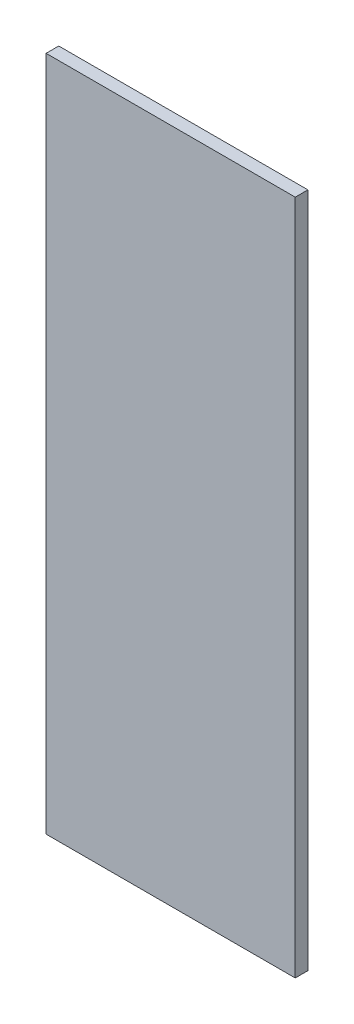
ISO-10303-21;
HEADER;
FILE_DESCRIPTION(('STEP AP214'),'2;1');
FILE_NAME('part.step','',(''),(''),'','','');
FILE_SCHEMA(('AUTOMOTIVE_DESIGN { 1 0 10303 214 1 1 1 1 }'));
ENDSEC;
DATA;
#1=APPLICATION_CONTEXT('core data for automotive mechanical design processes');
#2=APPLICATION_PROTOCOL_DEFINITION('international standard','automotive_design',2000,#1);
#3=PRODUCT_CONTEXT('',#1,'mechanical');
#4=PRODUCT('Part','Part','',(#3));
#5=PRODUCT_RELATED_PRODUCT_CATEGORY('part','',(#4));
#6=PRODUCT_DEFINITION_FORMATION('','',#4);
#7=PRODUCT_DEFINITION_CONTEXT('part definition',#1,'design');
#8=PRODUCT_DEFINITION('design','',#6,#7);
#9=PRODUCT_DEFINITION_SHAPE('','',#8);
#10=(LENGTH_UNIT() NAMED_UNIT(*) SI_UNIT(.MILLI.,.METRE.));
#11=(NAMED_UNIT(*) PLANE_ANGLE_UNIT() SI_UNIT($,.RADIAN.));
#12=(NAMED_UNIT(*) SI_UNIT($,.STERADIAN.) SOLID_ANGLE_UNIT());
#13=UNCERTAINTY_MEASURE_WITH_UNIT(LENGTH_MEASURE(1.E-05),#10,'distance_accuracy_value','');
#14=(GEOMETRIC_REPRESENTATION_CONTEXT(3) GLOBAL_UNCERTAINTY_ASSIGNED_CONTEXT((#13)) GLOBAL_UNIT_ASSIGNED_CONTEXT((#10,
#11,#12)) REPRESENTATION_CONTEXT('',''));
#15=CARTESIAN_POINT('',(0.,0.,0.));
#16=DIRECTION('',(0.,0.,1.));
#17=DIRECTION('',(1.,0.,0.));
#18=AXIS2_PLACEMENT_3D('',#15,#16,#17);
#19=CARTESIAN_POINT('',(94.1920013427735,76.5279998779297,0.));
#20=DIRECTION('',(1.,0.,0.));
#21=DIRECTION('',(0.,-1.,0.));
#22=AXIS2_PLACEMENT_3D('',#19,#20,#21);
#23=PLANE('',#22);
#24=DIRECTION('',(0.,-1.,0.));
#25=VECTOR('',#24,1.);
#26=CARTESIAN_POINT('',(94.1920013427734,76.5279998779297,0.03556));
#27=LINE('',#26,#25);
#28=CARTESIAN_POINT('',(94.1920013427734,76.5279998779297,0.03556));
#29=VERTEX_POINT('',#28);
#30=CARTESIAN_POINT('',(94.1920013427734,74.6279983520508,0.03556));
#31=VERTEX_POINT('',#30);
#32=EDGE_CURVE('E11',#29,#31,#27,.T.);
#33=ORIENTED_EDGE('',*,*,#32,.F.);
#34=DIRECTION('',(0.,0.,1.));
#35=VECTOR('',#34,1.);
#36=CARTESIAN_POINT('',(94.1920013427734,76.5279998779297,0.));
#37=LINE('',#36,#35);
#38=CARTESIAN_POINT('',(94.1920013427734,76.5279998779297,0.));
#39=VERTEX_POINT('',#38);
#40=EDGE_CURVE('E24',#39,#29,#37,.T.);
#41=ORIENTED_EDGE('',*,*,#40,.F.);
#42=DIRECTION('',(0.,-1.,0.));
#43=VECTOR('',#42,1.);
#44=CARTESIAN_POINT('',(94.1920013427734,76.5279998779297,0.));
#45=LINE('',#44,#43);
#46=CARTESIAN_POINT('',(94.1920013427734,74.6279983520508,0.));
#47=VERTEX_POINT('',#46);
#48=EDGE_CURVE('E75',#39,#47,#45,.T.);
#49=ORIENTED_EDGE('',*,*,#48,.T.);
#50=DIRECTION('',(0.,0.,1.));
#51=VECTOR('',#50,1.);
#52=CARTESIAN_POINT('',(94.1920013427734,74.6279983520508,0.));
#53=LINE('',#52,#51);
#54=EDGE_CURVE('E37',#47,#31,#53,.T.);
#55=ORIENTED_EDGE('',*,*,#54,.T.);
#56=EDGE_LOOP('',(#33,#41,#49,#55));
#57=FACE_BOUND('',#56,.T.);
#58=ADVANCED_FACE('F17',(#57),#23,.F.);
#59=CARTESIAN_POINT('',(94.1920013427735,74.6279983520508,0.));
#60=DIRECTION('',(0.,1.,0.));
#61=DIRECTION('',(1.,0.,0.));
#62=AXIS2_PLACEMENT_3D('',#59,#60,#61);
#63=PLANE('',#62);
#64=DIRECTION('',(1.,0.,0.));
#65=VECTOR('',#64,1.);
#66=CARTESIAN_POINT('',(94.1920013427734,74.6279983520508,0.03556));
#67=LINE('',#66,#65);
#68=CARTESIAN_POINT('',(94.8919982910156,74.6279983520508,0.03556));
#69=VERTEX_POINT('',#68);
#70=EDGE_CURVE('E83',#31,#69,#67,.T.);
#71=ORIENTED_EDGE('',*,*,#70,.F.);
#72=ORIENTED_EDGE('',*,*,#54,.F.);
#73=DIRECTION('',(1.,0.,0.));
#74=VECTOR('',#73,1.);
#75=CARTESIAN_POINT('',(94.1920013427734,74.6279983520508,0.));
#76=LINE('',#75,#74);
#77=CARTESIAN_POINT('',(94.8919982910156,74.6279983520508,0.));
#78=VERTEX_POINT('',#77);
#79=EDGE_CURVE('E81',#47,#78,#76,.T.);
#80=ORIENTED_EDGE('',*,*,#79,.T.);
#81=DIRECTION('',(0.,0.,1.));
#82=VECTOR('',#81,1.);
#83=CARTESIAN_POINT('',(94.8919982910156,74.6279983520508,0.));
#84=LINE('',#83,#82);
#85=EDGE_CURVE('E67',#78,#69,#84,.T.);
#86=ORIENTED_EDGE('',*,*,#85,.T.);
#87=EDGE_LOOP('',(#71,#72,#80,#86));
#88=FACE_BOUND('',#87,.T.);
#89=ADVANCED_FACE('F89',(#88),#63,.F.);
#90=CARTESIAN_POINT('',(94.8919982910156,74.6279983520508,0.));
#91=DIRECTION('',(-1.,0.,0.));
#92=DIRECTION('',(0.,1.,0.));
#93=AXIS2_PLACEMENT_3D('',#90,#91,#92);
#94=PLANE('',#93);
#95=DIRECTION('',(0.,1.,0.));
#96=VECTOR('',#95,1.);
#97=CARTESIAN_POINT('',(94.8919982910156,74.6279983520508,0.03556));
#98=LINE('',#97,#96);
#99=CARTESIAN_POINT('',(94.8919982910156,76.5279998779297,0.03556));
#100=VERTEX_POINT('',#99);
#101=EDGE_CURVE('E71',#69,#100,#98,.T.);
#102=ORIENTED_EDGE('',*,*,#101,.F.);
#103=ORIENTED_EDGE('',*,*,#85,.F.);
#104=DIRECTION('',(0.,1.,0.));
#105=VECTOR('',#104,1.);
#106=CARTESIAN_POINT('',(94.8919982910156,74.6279983520508,0.));
#107=LINE('',#106,#105);
#108=CARTESIAN_POINT('',(94.8919982910156,76.5279998779297,0.));
#109=VERTEX_POINT('',#108);
#110=EDGE_CURVE('E63',#78,#109,#107,.T.);
#111=ORIENTED_EDGE('',*,*,#110,.T.);
#112=DIRECTION('',(0.,0.,1.));
#113=VECTOR('',#112,1.);
#114=CARTESIAN_POINT('',(94.8919982910156,76.5279998779297,0.));
#115=LINE('',#114,#113);
#116=EDGE_CURVE('E53',#109,#100,#115,.T.);
#117=ORIENTED_EDGE('',*,*,#116,.T.);
#118=EDGE_LOOP('',(#102,#103,#111,#117));
#119=FACE_BOUND('',#118,.T.);
#120=ADVANCED_FACE('F66',(#119),#94,.F.);
#121=CARTESIAN_POINT('',(94.8919982910156,76.5279998779297,0.));
#122=DIRECTION('',(0.,-1.,0.));
#123=DIRECTION('',(-1.,0.,0.));
#124=AXIS2_PLACEMENT_3D('',#121,#122,#123);
#125=PLANE('',#124);
#126=DIRECTION('',(-1.,0.,0.));
#127=VECTOR('',#126,1.);
#128=CARTESIAN_POINT('',(94.8919982910156,76.5279998779297,0.03556));
#129=LINE('',#128,#127);
#130=EDGE_CURVE('E59',#100,#29,#129,.T.);
#131=ORIENTED_EDGE('',*,*,#130,.F.);
#132=ORIENTED_EDGE('',*,*,#116,.F.);
#133=DIRECTION('',(-1.,0.,0.));
#134=VECTOR('',#133,1.);
#135=CARTESIAN_POINT('',(94.8919982910156,76.5279998779297,0.));
#136=LINE('',#135,#134);
#137=EDGE_CURVE('E57',#109,#39,#136,.T.);
#138=ORIENTED_EDGE('',*,*,#137,.T.);
#139=ORIENTED_EDGE('',*,*,#40,.T.);
#140=EDGE_LOOP('',(#131,#132,#138,#139));
#141=FACE_BOUND('',#140,.T.);
#142=ADVANCED_FACE('F55',(#141),#125,.F.);
#143=CARTESIAN_POINT('',(94.1920013427735,76.5279998779297,0.));
#144=DIRECTION('',(0.,0.,-1.));
#145=DIRECTION('',(-1.,0.,0.));
#146=AXIS2_PLACEMENT_3D('',#143,#144,#145);
#147=PLANE('',#146);
#148=ORIENTED_EDGE('',*,*,#137,.F.);
#149=ORIENTED_EDGE('',*,*,#110,.F.);
#150=ORIENTED_EDGE('',*,*,#79,.F.);
#151=ORIENTED_EDGE('',*,*,#48,.F.);
#152=EDGE_LOOP('',(#148,#149,#150,#151));
#153=FACE_BOUND('',#152,.T.);
#154=ADVANCED_FACE('F74',(#153),#147,.T.);
#155=CARTESIAN_POINT('',(94.1920013427735,76.5279998779297,0.03556));
#156=DIRECTION('',(0.,0.,-1.));
#157=DIRECTION('',(-1.,0.,0.));
#158=AXIS2_PLACEMENT_3D('',#155,#156,#157);
#159=PLANE('',#158);
#160=ORIENTED_EDGE('',*,*,#32,.T.);
#161=ORIENTED_EDGE('',*,*,#70,.T.);
#162=ORIENTED_EDGE('',*,*,#101,.T.);
#163=ORIENTED_EDGE('',*,*,#130,.T.);
#164=EDGE_LOOP('',(#160,#161,#162,#163));
#165=FACE_BOUND('',#164,.T.);
#166=ADVANCED_FACE('F91',(#165),#159,.F.);
#167=CLOSED_SHELL('',(#58,#89,#120,#142,#154,#166));
#168=MANIFOLD_SOLID_BREP('B1',#167);
#169=ADVANCED_BREP_SHAPE_REPRESENTATION('',(#18,#168),#14);
#170=SHAPE_DEFINITION_REPRESENTATION(#9,#169);
ENDSEC;
END-ISO-10303-21;
